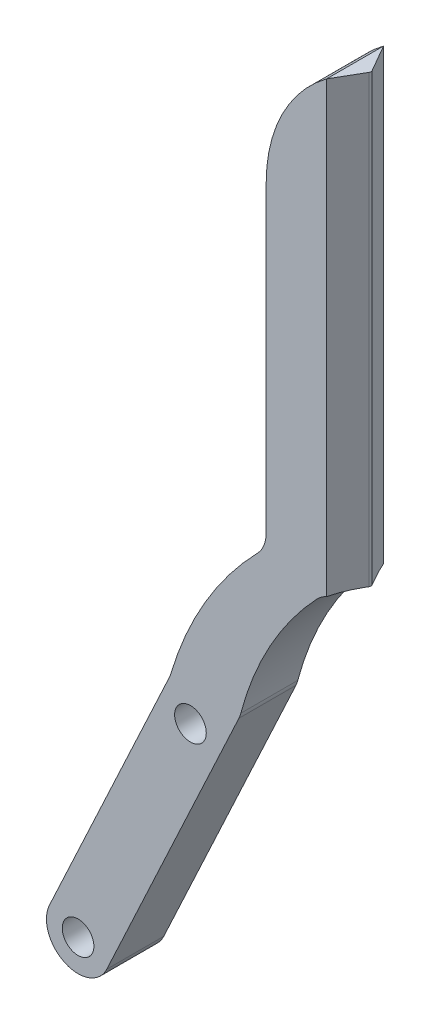
ISO-10303-21;
HEADER;
FILE_DESCRIPTION(('STEP AP214'),'2;1');
FILE_NAME('part.step','',(''),(''),'','','');
FILE_SCHEMA(('AUTOMOTIVE_DESIGN { 1 0 10303 214 1 1 1 1 }'));
ENDSEC;
DATA;
#1=APPLICATION_CONTEXT('core data for automotive mechanical design processes');
#2=APPLICATION_PROTOCOL_DEFINITION('international standard','automotive_design',2000,#1);
#3=PRODUCT_CONTEXT('',#1,'mechanical');
#4=PRODUCT('Part','Part','',(#3));
#5=PRODUCT_RELATED_PRODUCT_CATEGORY('part','',(#4));
#6=PRODUCT_DEFINITION_FORMATION('','',#4);
#7=PRODUCT_DEFINITION_CONTEXT('part definition',#1,'design');
#8=PRODUCT_DEFINITION('design','',#6,#7);
#9=PRODUCT_DEFINITION_SHAPE('','',#8);
#10=(LENGTH_UNIT() NAMED_UNIT(*) SI_UNIT(.MILLI.,.METRE.));
#11=(NAMED_UNIT(*) PLANE_ANGLE_UNIT() SI_UNIT($,.RADIAN.));
#12=(NAMED_UNIT(*) SI_UNIT($,.STERADIAN.) SOLID_ANGLE_UNIT());
#13=UNCERTAINTY_MEASURE_WITH_UNIT(LENGTH_MEASURE(1.E-05),#10,'distance_accuracy_value','');
#14=(GEOMETRIC_REPRESENTATION_CONTEXT(3) GLOBAL_UNCERTAINTY_ASSIGNED_CONTEXT((#13)) GLOBAL_UNIT_ASSIGNED_CONTEXT((#10,
#11,#12)) REPRESENTATION_CONTEXT('',''));
#15=CARTESIAN_POINT('',(0.,0.,0.));
#16=DIRECTION('',(0.,0.,1.));
#17=DIRECTION('',(1.,0.,0.));
#18=AXIS2_PLACEMENT_3D('',#15,#16,#17);
#19=CARTESIAN_POINT('',(48.4677734694505,-12.2831158471306,9.));
#20=DIRECTION('',(0.,0.,-1.));
#21=DIRECTION('',(-1.,0.,0.));
#22=AXIS2_PLACEMENT_3D('',#19,#20,#21);
#23=PLANE('',#22);
#24=DIRECTION('',(0.4226182617407,0.90630778703665,0.));
#25=VECTOR('',#24,1.);
#26=CARTESIAN_POINT('',(-21.0668559435136,-45.1780183642428,9.));
#27=LINE('',#26,#25);
#28=CARTESIAN_POINT('',(-21.0668559435136,-45.1780183642428,9.));
#29=VERTEX_POINT('',#28);
#30=CARTESIAN_POINT('',(-0.194566106065847,-0.41724836095481,9.));
#31=VERTEX_POINT('',#30);
#32=EDGE_CURVE('E202',#29,#31,#27,.T.);
#33=ORIENTED_EDGE('',*,*,#32,.T.);
#34=CARTESIAN_POINT('',(-4.72610504124909,1.69584294774869,9.));
#35=DIRECTION('',(0.,0.,-1.));
#36=DIRECTION('',(-1.,0.,0.));
#37=AXIS2_PLACEMENT_3D('',#34,#35,#36);
#38=CIRCLE('',#37,5.);
#39=CARTESIAN_POINT('',(0.109702096087232,0.425028511850573,9.));
#40=VERTEX_POINT('',#39);
#41=EDGE_CURVE('E266',#31,#40,#38,.F.);
#42=ORIENTED_EDGE('',*,*,#41,.T.);
#43=CARTESIAN_POINT('',(48.4677734694505,-12.2831158471306,9.));
#44=DIRECTION('',(0.,0.,-1.));
#45=DIRECTION('',(-1.,0.,0.));
#46=AXIS2_PLACEMENT_3D('',#43,#44,#45);
#47=CIRCLE('',#46,50.);
#48=CARTESIAN_POINT('',(12.1048623619634,22.0350818880213,9.));
#49=VERTEX_POINT('',#48);
#50=EDGE_CURVE('E183',#40,#49,#47,.T.);
#51=ORIENTED_EDGE('',*,*,#50,.T.);
#52=CARTESIAN_POINT('',(15.7411534727121,18.6032621145062,9.));
#53=DIRECTION('',(0.,0.,-1.));
#54=DIRECTION('',(-1.,0.,0.));
#55=AXIS2_PLACEMENT_3D('',#52,#53,#54);
#56=CIRCLE('',#55,5.);
#57=CARTESIAN_POINT('',(13.6515721144125,23.145689851636,9.));
#58=VERTEX_POINT('',#57);
#59=EDGE_CURVE('E173',#49,#58,#56,.T.);
#60=ORIENTED_EDGE('',*,*,#59,.T.);
#61=DIRECTION('',(0.,-1.,0.));
#62=VECTOR('',#61,1.);
#63=CARTESIAN_POINT('',(13.6515721144125,95.,9.));
#64=LINE('',#63,#62);
#65=CARTESIAN_POINT('',(13.6515721144125,93.9716156813867,9.));
#66=VERTEX_POINT('',#65);
#67=EDGE_CURVE('E63',#66,#58,#64,.T.);
#68=ORIENTED_EDGE('',*,*,#67,.F.);
#69=CARTESIAN_POINT('',(27.760838260333,75.,9.));
#70=DIRECTION('',(0.,0.,1.));
#71=DIRECTION('',(-1.,0.,0.));
#72=AXIS2_PLACEMENT_3D('',#69,#70,#71);
#73=CIRCLE('',#72,23.6430453355455);
#74=CARTESIAN_POINT('',(4.11779292478757,75.,9.));
#75=VERTEX_POINT('',#74);
#76=EDGE_CURVE('E170',#66,#75,#73,.T.);
#77=ORIENTED_EDGE('',*,*,#76,.T.);
#78=DIRECTION('',(0.,-1.,0.));
#79=VECTOR('',#78,1.);
#80=CARTESIAN_POINT('',(4.11779292478757,25.,9.));
#81=LINE('',#80,#79);
#82=CARTESIAN_POINT('',(4.11779292478757,27.0818552594882,9.));
#83=VERTEX_POINT('',#82);
#84=EDGE_CURVE('E182',#75,#83,#81,.T.);
#85=ORIENTED_EDGE('',*,*,#84,.T.);
#86=CARTESIAN_POINT('',(-0.88220707521243,27.0818552594882,9.));
#87=DIRECTION('',(0.,0.,-1.));
#88=DIRECTION('',(-1.,0.,0.));
#89=AXIS2_PLACEMENT_3D('',#86,#87,#88);
#90=CIRCLE('',#89,5.);
#91=CARTESIAN_POINT('',(2.70122840962534,23.5948809082769,9.));
#92=VERTEX_POINT('',#91);
#93=EDGE_CURVE('E11',#83,#92,#90,.T.);
#94=ORIENTED_EDGE('',*,*,#93,.T.);
#95=CARTESIAN_POINT('',(43.1017984548103,-15.7181615946366,9.));
#96=DIRECTION('',(0.,0.,1.));
#97=DIRECTION('',(-1.,0.,0.));
#98=AXIS2_PLACEMENT_3D('',#95,#96,#97);
#99=CIRCLE('',#98,56.3712814366659);
#100=CARTESIAN_POINT('',(-10.9319438291231,0.346584453939657,9.));
#101=VERTEX_POINT('',#100);
#102=EDGE_CURVE('E187',#92,#101,#99,.T.);
#103=ORIENTED_EDGE('',*,*,#102,.T.);
#104=CARTESIAN_POINT('',(-15.7246096074097,1.77148962188633,9.));
#105=DIRECTION('',(0.,0.,-1.));
#106=DIRECTION('',(-1.,0.,0.));
#107=AXIS2_PLACEMENT_3D('',#104,#105,#106);
#108=CIRCLE('',#107,5.);
#109=CARTESIAN_POINT('',(-11.1930706722264,-0.341601686817169,9.));
#110=VERTEX_POINT('',#109);
#111=EDGE_CURVE('E300',#101,#110,#108,.T.);
#112=ORIENTED_EDGE('',*,*,#111,.T.);
#113=DIRECTION('',(-0.4226182617407,-0.90630778703665,0.));
#114=VECTOR('',#113,1.);
#115=CARTESIAN_POINT('',(-11.0337791896249,0.,9.));
#116=LINE('',#115,#114);
#117=CARTESIAN_POINT('',(-30.1299338138801,-40.9518357468358,9.));
#118=VERTEX_POINT('',#117);
#119=EDGE_CURVE('E196',#110,#118,#116,.T.);
#120=ORIENTED_EDGE('',*,*,#119,.T.);
#121=CARTESIAN_POINT('',(-25.5983948786969,-43.0649270555393,9.));
#122=DIRECTION('',(0.,0.,1.));
#123=DIRECTION('',(1.,0.,0.));
#124=AXIS2_PLACEMENT_3D('',#121,#122,#123);
#125=CIRCLE('',#124,5.);
#126=EDGE_CURVE('E199',#118,#29,#125,.T.);
#127=ORIENTED_EDGE('',*,*,#126,.T.);
#128=EDGE_LOOP('',(#33,#42,#51,#60,#68,#77,#85,#94,#103,#112,#120,#127));
#129=FACE_BOUND('',#128,.T.);
#130=CARTESIAN_POINT('',(-7.84842788558752,-5.,9.));
#131=DIRECTION('',(0.,0.,1.));
#132=DIRECTION('',(1.,0.,0.));
#133=AXIS2_PLACEMENT_3D('',#130,#131,#132);
#134=CIRCLE('',#133,2.5);
#135=CARTESIAN_POINT('',(-5.34842788558752,-5.,9.));
#136=VERTEX_POINT('',#135);
#137=EDGE_CURVE('E211',#136,#136,#134,.T.);
#138=ORIENTED_EDGE('',*,*,#137,.F.);
#139=EDGE_LOOP('',(#138));
#140=FACE_BOUND('',#139,.T.);
#141=CARTESIAN_POINT('',(-25.5983948786969,-43.0649270555393,9.));
#142=DIRECTION('',(0.,0.,1.));
#143=DIRECTION('',(1.,0.,0.));
#144=AXIS2_PLACEMENT_3D('',#141,#142,#143);
#145=CIRCLE('',#144,2.5);
#146=CARTESIAN_POINT('',(-23.0983948786968,-43.0649270555393,9.));
#147=VERTEX_POINT('',#146);
#148=EDGE_CURVE('E364',#147,#147,#145,.T.);
#149=ORIENTED_EDGE('',*,*,#148,.F.);
#150=EDGE_LOOP('',(#149));
#151=FACE_BOUND('',#150,.T.);
#152=ADVANCED_FACE('F39',(#129,#140,#151),#23,.F.);
#153=CARTESIAN_POINT('',(48.4677734694505,-12.2831158471306,0.));
#154=DIRECTION('',(0.,0.,-1.));
#155=DIRECTION('',(-1.,0.,0.));
#156=AXIS2_PLACEMENT_3D('',#153,#154,#155);
#157=PLANE('',#156);
#158=CARTESIAN_POINT('',(48.4677734694505,-12.2831158471306,0.));
#159=DIRECTION('',(0.,0.,-1.));
#160=DIRECTION('',(-1.,0.,0.));
#161=AXIS2_PLACEMENT_3D('',#158,#159,#160);
#162=CIRCLE('',#161,50.);
#163=CARTESIAN_POINT('',(0.109702096087232,0.425028511850573,0.));
#164=VERTEX_POINT('',#163);
#165=CARTESIAN_POINT('',(12.1048623619634,22.0350818880213,0.));
#166=VERTEX_POINT('',#165);
#167=EDGE_CURVE('E206',#164,#166,#162,.T.);
#168=ORIENTED_EDGE('',*,*,#167,.F.);
#169=CARTESIAN_POINT('',(-4.72610504124909,1.69584294774869,0.));
#170=DIRECTION('',(0.,0.,-1.));
#171=DIRECTION('',(-1.,0.,0.));
#172=AXIS2_PLACEMENT_3D('',#169,#170,#171);
#173=CIRCLE('',#172,5.);
#174=CARTESIAN_POINT('',(-0.194566106065847,-0.41724836095481,0.));
#175=VERTEX_POINT('',#174);
#176=EDGE_CURVE('E260',#164,#175,#173,.T.);
#177=ORIENTED_EDGE('',*,*,#176,.T.);
#178=DIRECTION('',(0.4226182617407,0.90630778703665,0.));
#179=VECTOR('',#178,1.);
#180=CARTESIAN_POINT('',(-21.0668559435136,-45.1780183642428,0.));
#181=LINE('',#180,#179);
#182=CARTESIAN_POINT('',(-21.0668559435136,-45.1780183642428,0.));
#183=VERTEX_POINT('',#182);
#184=EDGE_CURVE('E189',#183,#175,#181,.T.);
#185=ORIENTED_EDGE('',*,*,#184,.F.);
#186=CARTESIAN_POINT('',(-25.5983948786969,-43.0649270555393,0.));
#187=DIRECTION('',(0.,0.,1.));
#188=DIRECTION('',(1.,0.,0.));
#189=AXIS2_PLACEMENT_3D('',#186,#187,#188);
#190=CIRCLE('',#189,5.);
#191=CARTESIAN_POINT('',(-30.1299338138801,-40.9518357468358,0.));
#192=VERTEX_POINT('',#191);
#193=EDGE_CURVE('E225',#192,#183,#190,.T.);
#194=ORIENTED_EDGE('',*,*,#193,.F.);
#195=DIRECTION('',(-0.4226182617407,-0.90630778703665,0.));
#196=VECTOR('',#195,1.);
#197=CARTESIAN_POINT('',(-11.0337791896249,0.,0.));
#198=LINE('',#197,#196);
#199=CARTESIAN_POINT('',(-11.1930706722264,-0.341601686817169,0.));
#200=VERTEX_POINT('',#199);
#201=EDGE_CURVE('E222',#200,#192,#198,.T.);
#202=ORIENTED_EDGE('',*,*,#201,.F.);
#203=CARTESIAN_POINT('',(-15.7246096074097,1.77148962188633,0.));
#204=DIRECTION('',(0.,0.,-1.));
#205=DIRECTION('',(-1.,0.,0.));
#206=AXIS2_PLACEMENT_3D('',#203,#204,#205);
#207=CIRCLE('',#206,5.);
#208=CARTESIAN_POINT('',(-10.9319438291231,0.346584453939657,0.));
#209=VERTEX_POINT('',#208);
#210=EDGE_CURVE('E297',#200,#209,#207,.F.);
#211=ORIENTED_EDGE('',*,*,#210,.T.);
#212=CARTESIAN_POINT('',(43.1017984548103,-15.7181615946366,0.));
#213=DIRECTION('',(0.,0.,1.));
#214=DIRECTION('',(-1.,0.,0.));
#215=AXIS2_PLACEMENT_3D('',#212,#213,#214);
#216=CIRCLE('',#215,56.3712814366659);
#217=CARTESIAN_POINT('',(2.70122840962534,23.5948809082769,0.));
#218=VERTEX_POINT('',#217);
#219=EDGE_CURVE('E218',#218,#209,#216,.T.);
#220=ORIENTED_EDGE('',*,*,#219,.F.);
#221=CARTESIAN_POINT('',(-0.88220707521243,27.0818552594882,0.));
#222=DIRECTION('',(0.,0.,-1.));
#223=DIRECTION('',(-1.,0.,0.));
#224=AXIS2_PLACEMENT_3D('',#221,#222,#223);
#225=CIRCLE('',#224,5.);
#226=CARTESIAN_POINT('',(4.11779292478757,27.0818552594882,0.));
#227=VERTEX_POINT('',#226);
#228=EDGE_CURVE('E48',#218,#227,#225,.F.);
#229=ORIENTED_EDGE('',*,*,#228,.T.);
#230=DIRECTION('',(0.,-1.,0.));
#231=VECTOR('',#230,1.);
#232=CARTESIAN_POINT('',(4.11779292478757,25.,0.));
#233=LINE('',#232,#231);
#234=CARTESIAN_POINT('',(4.11779292478757,75.,0.));
#235=VERTEX_POINT('',#234);
#236=EDGE_CURVE('E214',#235,#227,#233,.T.);
#237=ORIENTED_EDGE('',*,*,#236,.F.);
#238=CARTESIAN_POINT('',(27.760838260333,75.,0.));
#239=DIRECTION('',(0.,0.,1.));
#240=DIRECTION('',(-1.,0.,0.));
#241=AXIS2_PLACEMENT_3D('',#238,#239,#240);
#242=CIRCLE('',#241,23.6430453355455);
#243=CARTESIAN_POINT('',(13.6515721144125,93.9716156813867,0.));
#244=VERTEX_POINT('',#243);
#245=EDGE_CURVE('E210',#244,#235,#242,.T.);
#246=ORIENTED_EDGE('',*,*,#245,.F.);
#247=DIRECTION('',(0.,-1.,0.));
#248=VECTOR('',#247,1.);
#249=CARTESIAN_POINT('',(13.6515721144125,95.,0.));
#250=LINE('',#249,#248);
#251=CARTESIAN_POINT('',(13.6515721144125,23.145689851636,0.));
#252=VERTEX_POINT('',#251);
#253=EDGE_CURVE('E55',#244,#252,#250,.T.);
#254=ORIENTED_EDGE('',*,*,#253,.T.);
#255=CARTESIAN_POINT('',(15.7411534727121,18.6032621145062,0.));
#256=DIRECTION('',(0.,0.,-1.));
#257=DIRECTION('',(-1.,0.,0.));
#258=AXIS2_PLACEMENT_3D('',#255,#256,#257);
#259=CIRCLE('',#258,5.);
#260=EDGE_CURVE('E294',#252,#166,#259,.F.);
#261=ORIENTED_EDGE('',*,*,#260,.T.);
#262=EDGE_LOOP('',(#168,#177,#185,#194,#202,#211,#220,#229,#237,#246,#254,#261));
#263=FACE_BOUND('',#262,.T.);
#264=CARTESIAN_POINT('',(-7.84842788558752,-5.,0.));
#265=DIRECTION('',(0.,0.,1.));
#266=DIRECTION('',(1.,0.,0.));
#267=AXIS2_PLACEMENT_3D('',#264,#265,#266);
#268=CIRCLE('',#267,2.5);
#269=CARTESIAN_POINT('',(-5.34842788558752,-5.,0.));
#270=VERTEX_POINT('',#269);
#271=EDGE_CURVE('E368',#270,#270,#268,.T.);
#272=ORIENTED_EDGE('',*,*,#271,.T.);
#273=EDGE_LOOP('',(#272));
#274=FACE_BOUND('',#273,.T.);
#275=CARTESIAN_POINT('',(-25.5983948786969,-43.0649270555393,0.));
#276=DIRECTION('',(0.,0.,1.));
#277=DIRECTION('',(1.,0.,0.));
#278=AXIS2_PLACEMENT_3D('',#275,#276,#277);
#279=CIRCLE('',#278,2.5);
#280=CARTESIAN_POINT('',(-23.0983948786968,-43.0649270555393,0.));
#281=VERTEX_POINT('',#280);
#282=EDGE_CURVE('E362',#281,#281,#279,.T.);
#283=ORIENTED_EDGE('',*,*,#282,.T.);
#284=EDGE_LOOP('',(#283));
#285=FACE_BOUND('',#284,.T.);
#286=ADVANCED_FACE('F306',(#263,#274,#285),#157,.T.);
#287=CARTESIAN_POINT('',(48.4677734694505,-12.2831158471306,9.));
#288=DIRECTION('',(0.,0.,-1.));
#289=DIRECTION('',(-1.,0.,0.));
#290=AXIS2_PLACEMENT_3D('',#287,#288,#289);
#291=CYLINDRICAL_SURFACE('',#290,50.);
#292=ORIENTED_EDGE('',*,*,#50,.F.);
#293=DIRECTION('',(0.,0.,-1.));
#294=VECTOR('',#293,1.);
#295=CARTESIAN_POINT('',(0.109702096087232,0.425028511850571,9.));
#296=LINE('',#295,#294);
#297=EDGE_CURVE('E256',#40,#164,#296,.T.);
#298=ORIENTED_EDGE('',*,*,#297,.T.);
#299=ORIENTED_EDGE('',*,*,#167,.T.);
#300=DIRECTION('',(0.,0.,-1.));
#301=VECTOR('',#300,1.);
#302=CARTESIAN_POINT('',(12.1048623619634,22.0350818880213,9.));
#303=LINE('',#302,#301);
#304=EDGE_CURVE('E252',#166,#49,#303,.F.);
#305=ORIENTED_EDGE('',*,*,#304,.T.);
#306=EDGE_LOOP('',(#292,#298,#299,#305));
#307=FACE_BOUND('',#306,.T.);
#308=ADVANCED_FACE('F341',(#307),#291,.F.);
#309=CARTESIAN_POINT('',(27.760838260333,75.,9.));
#310=DIRECTION('',(0.,0.,-1.));
#311=DIRECTION('',(-1.,0.,0.));
#312=AXIS2_PLACEMENT_3D('',#309,#310,#311);
#313=CYLINDRICAL_SURFACE('',#312,23.6430453355455);
#314=ORIENTED_EDGE('',*,*,#76,.F.);
#315=DIRECTION('',(0.,0.,-1.));
#316=VECTOR('',#315,1.);
#317=CARTESIAN_POINT('',(13.6515721144125,93.9716156813867,9.));
#318=LINE('',#317,#316);
#319=EDGE_CURVE('E158',#66,#244,#318,.T.);
#320=ORIENTED_EDGE('',*,*,#319,.T.);
#321=ORIENTED_EDGE('',*,*,#245,.T.);
#322=DIRECTION('',(0.,0.,-1.));
#323=VECTOR('',#322,1.);
#324=CARTESIAN_POINT('',(4.11779292478757,75.,9.));
#325=LINE('',#324,#323);
#326=EDGE_CURVE('E164',#75,#235,#325,.T.);
#327=ORIENTED_EDGE('',*,*,#326,.F.);
#328=EDGE_LOOP('',(#314,#320,#321,#327));
#329=FACE_BOUND('',#328,.T.);
#330=ADVANCED_FACE('F178',(#329),#313,.T.);
#331=CARTESIAN_POINT('',(4.11779292478757,25.,9.));
#332=DIRECTION('',(1.,0.,0.));
#333=DIRECTION('',(0.,1.,0.));
#334=AXIS2_PLACEMENT_3D('',#331,#332,#333);
#335=PLANE('',#334);
#336=ORIENTED_EDGE('',*,*,#236,.T.);
#337=DIRECTION('',(0.,0.,1.));
#338=VECTOR('',#337,1.);
#339=CARTESIAN_POINT('',(4.11779292478757,27.0818552594882,9.));
#340=LINE('',#339,#338);
#341=EDGE_CURVE('E283',#227,#83,#340,.T.);
#342=ORIENTED_EDGE('',*,*,#341,.T.);
#343=ORIENTED_EDGE('',*,*,#84,.F.);
#344=ORIENTED_EDGE('',*,*,#326,.T.);
#345=EDGE_LOOP('',(#336,#342,#343,#344));
#346=FACE_BOUND('',#345,.T.);
#347=ADVANCED_FACE('F312',(#346),#335,.F.);
#348=CARTESIAN_POINT('',(43.1017984548103,-15.7181615946366,9.));
#349=DIRECTION('',(0.,0.,-1.));
#350=DIRECTION('',(-1.,0.,0.));
#351=AXIS2_PLACEMENT_3D('',#348,#349,#350);
#352=CYLINDRICAL_SURFACE('',#351,56.3712814366659);
#353=ORIENTED_EDGE('',*,*,#219,.T.);
#354=DIRECTION('',(0.,0.,-1.));
#355=VECTOR('',#354,1.);
#356=CARTESIAN_POINT('',(-10.9319438291231,0.346584453939657,9.));
#357=LINE('',#356,#355);
#358=EDGE_CURVE('E280',#209,#101,#357,.F.);
#359=ORIENTED_EDGE('',*,*,#358,.T.);
#360=ORIENTED_EDGE('',*,*,#102,.F.);
#361=DIRECTION('',(0.,0.,-1.));
#362=VECTOR('',#361,1.);
#363=CARTESIAN_POINT('',(2.70122840962533,23.5948809082769,9.));
#364=LINE('',#363,#362);
#365=EDGE_CURVE('E276',#92,#218,#364,.T.);
#366=ORIENTED_EDGE('',*,*,#365,.T.);
#367=EDGE_LOOP('',(#353,#359,#360,#366));
#368=FACE_BOUND('',#367,.T.);
#369=ADVANCED_FACE('F317',(#368),#352,.T.);
#370=CARTESIAN_POINT('',(-11.0337791896249,0.,9.));
#371=DIRECTION('',(0.906307787036649,-0.4226182617407,0.));
#372=DIRECTION('',(0.4226182617407,0.90630778703665,0.));
#373=AXIS2_PLACEMENT_3D('',#370,#371,#372);
#374=PLANE('',#373);
#375=ORIENTED_EDGE('',*,*,#119,.F.);
#376=DIRECTION('',(0.,0.,1.));
#377=VECTOR('',#376,1.);
#378=CARTESIAN_POINT('',(-11.1930706722264,-0.341601686817168,0.));
#379=LINE('',#378,#377);
#380=EDGE_CURVE('E272',#110,#200,#379,.F.);
#381=ORIENTED_EDGE('',*,*,#380,.T.);
#382=ORIENTED_EDGE('',*,*,#201,.T.);
#383=DIRECTION('',(0.,0.,-1.));
#384=VECTOR('',#383,1.);
#385=CARTESIAN_POINT('',(-30.1299338138801,-40.9518357468358,9.));
#386=LINE('',#385,#384);
#387=EDGE_CURVE('E234',#118,#192,#386,.T.);
#388=ORIENTED_EDGE('',*,*,#387,.F.);
#389=EDGE_LOOP('',(#375,#381,#382,#388));
#390=FACE_BOUND('',#389,.T.);
#391=ADVANCED_FACE('F325',(#390),#374,.F.);
#392=CARTESIAN_POINT('',(-25.5983948786969,-43.0649270555393,9.));
#393=DIRECTION('',(0.,0.,-1.));
#394=DIRECTION('',(-1.,0.,0.));
#395=AXIS2_PLACEMENT_3D('',#392,#393,#394);
#396=CYLINDRICAL_SURFACE('',#395,5.);
#397=ORIENTED_EDGE('',*,*,#193,.T.);
#398=DIRECTION('',(0.,0.,-1.));
#399=VECTOR('',#398,1.);
#400=CARTESIAN_POINT('',(-21.0668559435136,-45.1780183642428,9.));
#401=LINE('',#400,#399);
#402=EDGE_CURVE('E205',#29,#183,#401,.T.);
#403=ORIENTED_EDGE('',*,*,#402,.F.);
#404=ORIENTED_EDGE('',*,*,#126,.F.);
#405=ORIENTED_EDGE('',*,*,#387,.T.);
#406=EDGE_LOOP('',(#397,#403,#404,#405));
#407=FACE_BOUND('',#406,.T.);
#408=ADVANCED_FACE('F331',(#407),#396,.T.);
#409=CARTESIAN_POINT('',(-21.0668559435136,-45.1780183642428,9.));
#410=DIRECTION('',(-0.90630778703665,0.4226182617407,0.));
#411=DIRECTION('',(-0.4226182617407,-0.90630778703665,0.));
#412=AXIS2_PLACEMENT_3D('',#409,#410,#411);
#413=PLANE('',#412);
#414=ORIENTED_EDGE('',*,*,#184,.T.);
#415=DIRECTION('',(0.,0.,-1.));
#416=VECTOR('',#415,1.);
#417=CARTESIAN_POINT('',(-0.194566106065851,-0.41724836095481,9.));
#418=LINE('',#417,#416);
#419=EDGE_CURVE('E263',#175,#31,#418,.F.);
#420=ORIENTED_EDGE('',*,*,#419,.T.);
#421=ORIENTED_EDGE('',*,*,#32,.F.);
#422=ORIENTED_EDGE('',*,*,#402,.T.);
#423=EDGE_LOOP('',(#414,#420,#421,#422));
#424=FACE_BOUND('',#423,.T.);
#425=ADVANCED_FACE('F382',(#424),#413,.F.);
#426=CARTESIAN_POINT('',(-7.84842788558752,-5.,9.));
#427=DIRECTION('',(0.,0.,-1.));
#428=DIRECTION('',(-1.,0.,0.));
#429=AXIS2_PLACEMENT_3D('',#426,#427,#428);
#430=CYLINDRICAL_SURFACE('',#429,2.5);
#431=ORIENTED_EDGE('',*,*,#137,.T.);
#432=EDGE_LOOP('',(#431));
#433=FACE_BOUND('',#432,.T.);
#434=ORIENTED_EDGE('',*,*,#271,.F.);
#435=EDGE_LOOP('',(#434));
#436=FACE_BOUND('',#435,.T.);
#437=ADVANCED_FACE('F379',(#433,#436),#430,.F.);
#438=CARTESIAN_POINT('',(-25.5983948786969,-43.0649270555393,9.));
#439=DIRECTION('',(0.,0.,-1.));
#440=DIRECTION('',(-1.,0.,0.));
#441=AXIS2_PLACEMENT_3D('',#438,#439,#440);
#442=CYLINDRICAL_SURFACE('',#441,2.5);
#443=ORIENTED_EDGE('',*,*,#148,.T.);
#444=EDGE_LOOP('',(#443));
#445=FACE_BOUND('',#444,.T.);
#446=ORIENTED_EDGE('',*,*,#282,.F.);
#447=EDGE_LOOP('',(#446));
#448=FACE_BOUND('',#447,.T.);
#449=ADVANCED_FACE('F381',(#445,#448),#442,.F.);
#450=CARTESIAN_POINT('',(13.6515721144125,23.6032621145062,0.));
#451=DIRECTION('',(-0.866025403784439,0.,0.5));
#452=DIRECTION('',(0.5,0.,0.866025403784439));
#453=AXIS2_PLACEMENT_3D('',#450,#451,#452);
#454=PLANE('',#453);
#455=DIRECTION('',(0.5,0.,0.866025403784439));
#456=VECTOR('',#455,1.);
#457=CARTESIAN_POINT('',(13.6515721144125,93.9716156813867,0.));
#458=LINE('',#457,#456);
#459=CARTESIAN_POINT('',(16.1053107584684,93.9716156813867,4.25));
#460=VERTEX_POINT('',#459);
#461=EDGE_CURVE('E154',#244,#460,#458,.T.);
#462=ORIENTED_EDGE('',*,*,#461,.T.);
#463=DIRECTION('',(0.,1.,0.));
#464=VECTOR('',#463,1.);
#465=CARTESIAN_POINT('',(16.1053107584684,23.6032621145062,4.25));
#466=LINE('',#465,#464);
#467=CARTESIAN_POINT('',(16.1053107584684,23.6032621145062,4.25));
#468=VERTEX_POINT('',#467);
#469=EDGE_CURVE('E245',#460,#468,#466,.F.);
#470=ORIENTED_EDGE('',*,*,#469,.T.);
#471=DIRECTION('',(0.5,0.,0.866025403784439));
#472=VECTOR('',#471,1.);
#473=CARTESIAN_POINT('',(13.6515721144125,23.6032621145062,0.));
#474=LINE('',#473,#472);
#475=CARTESIAN_POINT('',(15.7411534727121,23.6032621145062,3.61926107912368));
#476=VERTEX_POINT('',#475);
#477=EDGE_CURVE('E153',#476,#468,#474,.T.);
#478=ORIENTED_EDGE('',*,*,#477,.F.);
#479=CARTESIAN_POINT('',(15.7411534727121,18.6032621145062,3.61926107912368));
#480=DIRECTION('',(-0.866025403784439,0.,0.5));
#481=DIRECTION('',(-0.5,0.,-0.866025403784439));
#482=AXIS2_PLACEMENT_3D('',#479,#480,#481);
#483=ELLIPSE('',#482,10.,5.);
#484=EDGE_CURVE('E291',#476,#252,#483,.T.);
#485=ORIENTED_EDGE('',*,*,#484,.T.);
#486=ORIENTED_EDGE('',*,*,#253,.F.);
#487=EDGE_LOOP('',(#462,#470,#478,#485,#486));
#488=FACE_BOUND('',#487,.T.);
#489=ADVANCED_FACE('F389',(#488),#454,.F.);
#490=CARTESIAN_POINT('',(16.2496483257658,23.6032621145062,4.5));
#491=DIRECTION('',(-0.866025403784439,0.,-0.5));
#492=DIRECTION('',(-0.5,0.,0.866025403784439));
#493=AXIS2_PLACEMENT_3D('',#490,#491,#492);
#494=PLANE('',#493);
#495=DIRECTION('',(-0.5,0.,0.866025403784439));
#496=VECTOR('',#495,1.);
#497=CARTESIAN_POINT('',(16.2496483257658,23.6032621145062,4.5));
#498=LINE('',#497,#496);
#499=CARTESIAN_POINT('',(16.1053107584684,23.6032621145062,4.75));
#500=VERTEX_POINT('',#499);
#501=CARTESIAN_POINT('',(15.7411534727121,23.6032621145062,5.38073892087632));
#502=VERTEX_POINT('',#501);
#503=EDGE_CURVE('E176',#500,#502,#498,.T.);
#504=ORIENTED_EDGE('',*,*,#503,.F.);
#505=DIRECTION('',(0.,1.,0.));
#506=VECTOR('',#505,1.);
#507=CARTESIAN_POINT('',(16.1053107584684,23.6032621145062,4.75));
#508=LINE('',#507,#506);
#509=CARTESIAN_POINT('',(16.1053107584684,93.9716156813867,4.75));
#510=VERTEX_POINT('',#509);
#511=EDGE_CURVE('E150',#500,#510,#508,.T.);
#512=ORIENTED_EDGE('',*,*,#511,.T.);
#513=DIRECTION('',(-0.5,0.,0.866025403784439));
#514=VECTOR('',#513,1.);
#515=CARTESIAN_POINT('',(16.2496483257658,93.9716156813867,4.5));
#516=LINE('',#515,#514);
#517=EDGE_CURVE('E145',#510,#66,#516,.T.);
#518=ORIENTED_EDGE('',*,*,#517,.T.);
#519=ORIENTED_EDGE('',*,*,#67,.T.);
#520=CARTESIAN_POINT('',(15.7411534727121,18.6032621145062,5.38073892087632));
#521=DIRECTION('',(-0.866025403784439,0.,-0.5));
#522=DIRECTION('',(0.5,0.,-0.866025403784439));
#523=AXIS2_PLACEMENT_3D('',#520,#521,#522);
#524=ELLIPSE('',#523,10.,5.);
#525=EDGE_CURVE('E288',#58,#502,#524,.T.);
#526=ORIENTED_EDGE('',*,*,#525,.T.);
#527=EDGE_LOOP('',(#504,#512,#518,#519,#526));
#528=FACE_BOUND('',#527,.T.);
#529=ADVANCED_FACE('F148',(#528),#494,.F.);
#530=CARTESIAN_POINT('',(0.,23.6032621145062,0.));
#531=DIRECTION('',(0.,-1.,0.));
#532=DIRECTION('',(0.,0.,-1.));
#533=AXIS2_PLACEMENT_3D('',#530,#531,#532);
#534=PLANE('',#533);
#535=ORIENTED_EDGE('',*,*,#503,.T.);
#536=DIRECTION('',(0.,0.,-1.));
#537=VECTOR('',#536,1.);
#538=CARTESIAN_POINT('',(15.7411534727121,23.6032621145062,0.));
#539=LINE('',#538,#537);
#540=EDGE_CURVE('E269',#502,#476,#539,.T.);
#541=ORIENTED_EDGE('',*,*,#540,.T.);
#542=ORIENTED_EDGE('',*,*,#477,.T.);
#543=CARTESIAN_POINT('',(15.6722980565762,23.6032621145062,4.5));
#544=DIRECTION('',(0.,-1.,0.));
#545=DIRECTION('',(0.,0.,-1.));
#546=AXIS2_PLACEMENT_3D('',#543,#544,#545);
#547=CIRCLE('',#546,0.5);
#548=EDGE_CURVE('E249',#468,#500,#547,.T.);
#549=ORIENTED_EDGE('',*,*,#548,.T.);
#550=EDGE_LOOP('',(#535,#541,#542,#549));
#551=FACE_BOUND('',#550,.T.);
#552=ADVANCED_FACE('F351',(#551),#534,.T.);
#553=CARTESIAN_POINT('',(0.,93.9716156813867,0.));
#554=DIRECTION('',(0.,-1.,0.));
#555=DIRECTION('',(0.,0.,-1.));
#556=AXIS2_PLACEMENT_3D('',#553,#554,#555);
#557=PLANE('',#556);
#558=ORIENTED_EDGE('',*,*,#517,.F.);
#559=CARTESIAN_POINT('',(15.6722980565762,93.9716156813867,4.5));
#560=DIRECTION('',(0.,-1.,0.));
#561=DIRECTION('',(0.,0.,-1.));
#562=AXIS2_PLACEMENT_3D('',#559,#560,#561);
#563=CIRCLE('',#562,0.5);
#564=EDGE_CURVE('E242',#510,#460,#563,.F.);
#565=ORIENTED_EDGE('',*,*,#564,.T.);
#566=ORIENTED_EDGE('',*,*,#461,.F.);
#567=ORIENTED_EDGE('',*,*,#319,.F.);
#568=EDGE_LOOP('',(#558,#565,#566,#567));
#569=FACE_BOUND('',#568,.T.);
#570=ADVANCED_FACE('F159',(#569),#557,.F.);
#571=CARTESIAN_POINT('',(15.6722980565762,23.6032621145062,4.5));
#572=DIRECTION('',(0.,1.,0.));
#573=DIRECTION('',(-1.,0.,0.));
#574=AXIS2_PLACEMENT_3D('',#571,#572,#573);
#575=CYLINDRICAL_SURFACE('',#574,0.5);
#576=ORIENTED_EDGE('',*,*,#548,.F.);
#577=ORIENTED_EDGE('',*,*,#469,.F.);
#578=ORIENTED_EDGE('',*,*,#564,.F.);
#579=ORIENTED_EDGE('',*,*,#511,.F.);
#580=EDGE_LOOP('',(#576,#577,#578,#579));
#581=FACE_BOUND('',#580,.T.);
#582=ADVANCED_FACE('F414',(#581),#575,.T.);
#583=CARTESIAN_POINT('',(-4.72610504124909,1.69584294774869,9.));
#584=DIRECTION('',(0.,0.,-1.));
#585=DIRECTION('',(-1.,0.,0.));
#586=AXIS2_PLACEMENT_3D('',#583,#584,#585);
#587=CYLINDRICAL_SURFACE('',#586,5.);
#588=ORIENTED_EDGE('',*,*,#41,.F.);
#589=ORIENTED_EDGE('',*,*,#419,.F.);
#590=ORIENTED_EDGE('',*,*,#176,.F.);
#591=ORIENTED_EDGE('',*,*,#297,.F.);
#592=EDGE_LOOP('',(#588,#589,#590,#591));
#593=FACE_BOUND('',#592,.T.);
#594=ADVANCED_FACE('F339',(#593),#587,.T.);
#595=CARTESIAN_POINT('',(15.7411534727121,18.6032621145062,9.));
#596=DIRECTION('',(0.,0.,-1.));
#597=DIRECTION('',(-1.,0.,0.));
#598=AXIS2_PLACEMENT_3D('',#595,#596,#597);
#599=CYLINDRICAL_SURFACE('',#598,5.);
#600=ORIENTED_EDGE('',*,*,#484,.F.);
#601=ORIENTED_EDGE('',*,*,#540,.F.);
#602=ORIENTED_EDGE('',*,*,#525,.F.);
#603=ORIENTED_EDGE('',*,*,#59,.F.);
#604=ORIENTED_EDGE('',*,*,#304,.F.);
#605=ORIENTED_EDGE('',*,*,#260,.F.);
#606=EDGE_LOOP('',(#600,#601,#602,#603,#604,#605));
#607=FACE_BOUND('',#606,.T.);
#608=ADVANCED_FACE('F347',(#607),#599,.F.);
#609=CARTESIAN_POINT('',(-15.7246096074097,1.77148962188633,9.));
#610=DIRECTION('',(0.,0.,-1.));
#611=DIRECTION('',(-1.,0.,0.));
#612=AXIS2_PLACEMENT_3D('',#609,#610,#611);
#613=CYLINDRICAL_SURFACE('',#612,5.);
#614=ORIENTED_EDGE('',*,*,#111,.F.);
#615=ORIENTED_EDGE('',*,*,#358,.F.);
#616=ORIENTED_EDGE('',*,*,#210,.F.);
#617=ORIENTED_EDGE('',*,*,#380,.F.);
#618=EDGE_LOOP('',(#614,#615,#616,#617));
#619=FACE_BOUND('',#618,.T.);
#620=ADVANCED_FACE('F320',(#619),#613,.F.);
#621=CARTESIAN_POINT('',(-0.88220707521243,27.0818552594882,9.));
#622=DIRECTION('',(0.,0.,-1.));
#623=DIRECTION('',(-1.,0.,0.));
#624=AXIS2_PLACEMENT_3D('',#621,#622,#623);
#625=CYLINDRICAL_SURFACE('',#624,5.);
#626=ORIENTED_EDGE('',*,*,#93,.F.);
#627=ORIENTED_EDGE('',*,*,#341,.F.);
#628=ORIENTED_EDGE('',*,*,#228,.F.);
#629=ORIENTED_EDGE('',*,*,#365,.F.);
#630=EDGE_LOOP('',(#626,#627,#628,#629));
#631=FACE_BOUND('',#630,.T.);
#632=ADVANCED_FACE('F41',(#631),#625,.F.);
#633=CLOSED_SHELL('',(#152,#286,#308,#330,#347,#369,#391,#408,#425,#437,#449,#489,#529,#552,
#570,#582,#594,#608,#620,#632));
#634=MANIFOLD_SOLID_BREP('B2',#633);
#635=ADVANCED_BREP_SHAPE_REPRESENTATION('',(#18,#634),#14);
#636=SHAPE_DEFINITION_REPRESENTATION(#9,#635);
ENDSEC;
END-ISO-10303-21;
